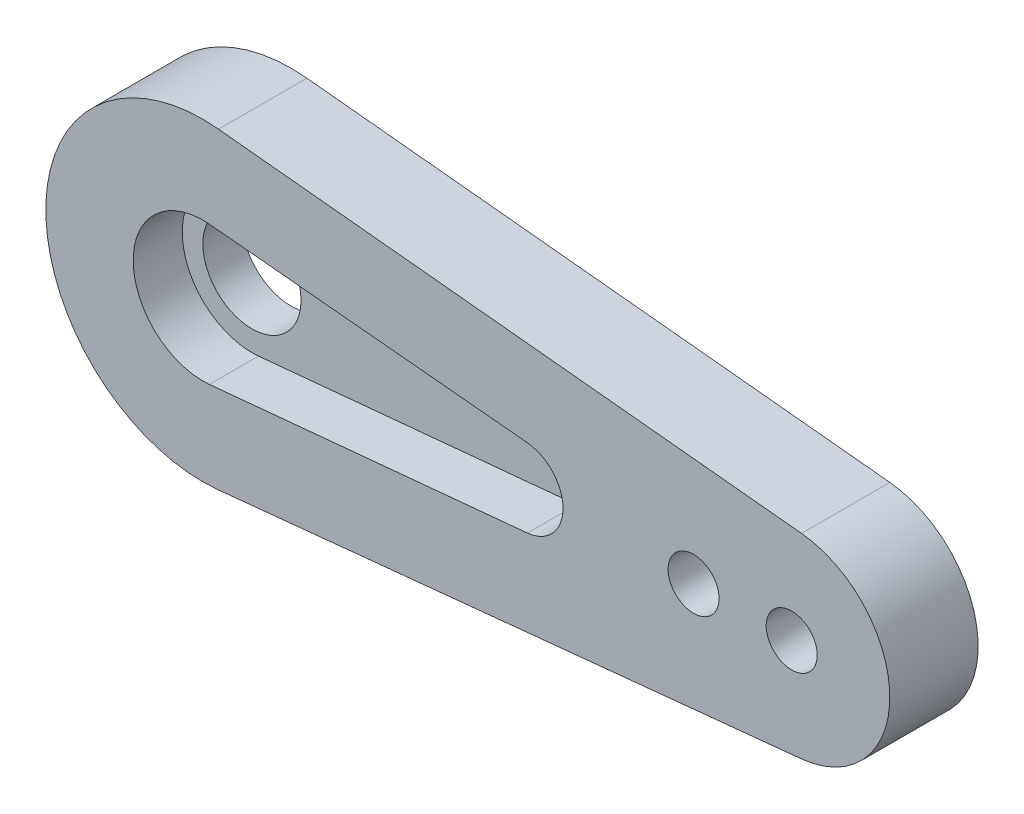
ISO-10303-21;
HEADER;
FILE_DESCRIPTION(('STEP AP214'),'2;1');
FILE_NAME('part.step','',(''),(''),'','','');
FILE_SCHEMA(('AUTOMOTIVE_DESIGN { 1 0 10303 214 1 1 1 1 }'));
ENDSEC;
DATA;
#1=APPLICATION_CONTEXT('core data for automotive mechanical design processes');
#2=APPLICATION_PROTOCOL_DEFINITION('international standard','automotive_design',2000,#1);
#3=PRODUCT_CONTEXT('',#1,'mechanical');
#4=PRODUCT('Part','Part','',(#3));
#5=PRODUCT_RELATED_PRODUCT_CATEGORY('part','',(#4));
#6=PRODUCT_DEFINITION_FORMATION('','',#4);
#7=PRODUCT_DEFINITION_CONTEXT('part definition',#1,'design');
#8=PRODUCT_DEFINITION('design','',#6,#7);
#9=PRODUCT_DEFINITION_SHAPE('','',#8);
#10=(LENGTH_UNIT() NAMED_UNIT(*) SI_UNIT(.MILLI.,.METRE.));
#11=(NAMED_UNIT(*) PLANE_ANGLE_UNIT() SI_UNIT($,.RADIAN.));
#12=(NAMED_UNIT(*) SI_UNIT($,.STERADIAN.) SOLID_ANGLE_UNIT());
#13=UNCERTAINTY_MEASURE_WITH_UNIT(LENGTH_MEASURE(1.E-05),#10,'distance_accuracy_value','');
#14=(GEOMETRIC_REPRESENTATION_CONTEXT(3) GLOBAL_UNCERTAINTY_ASSIGNED_CONTEXT((#13)) GLOBAL_UNIT_ASSIGNED_CONTEXT((#10,
#11,#12)) REPRESENTATION_CONTEXT('',''));
#15=CARTESIAN_POINT('',(0.,0.,0.));
#16=DIRECTION('',(0.,0.,1.));
#17=DIRECTION('',(1.,0.,0.));
#18=AXIS2_PLACEMENT_3D('',#15,#16,#17);
#19=CARTESIAN_POINT('',(0.,0.,2.5));
#20=DIRECTION('',(0.,0.,-1.));
#21=DIRECTION('',(-1.,0.,0.));
#22=AXIS2_PLACEMENT_3D('',#19,#20,#21);
#23=PLANE('',#22);
#24=CARTESIAN_POINT('',(25.,0.,2.5));
#25=DIRECTION('',(0.,0.,1.));
#26=DIRECTION('',(1.,0.,0.));
#27=AXIS2_PLACEMENT_3D('',#24,#25,#26);
#28=CIRCLE('',#27,1.3);
#29=CARTESIAN_POINT('',(26.3,0.,2.5));
#30=VERTEX_POINT('',#29);
#31=EDGE_CURVE('E281',#30,#30,#28,.T.);
#32=ORIENTED_EDGE('',*,*,#31,.F.);
#33=EDGE_LOOP('',(#32));
#34=FACE_BOUND('',#33,.T.);
#35=CARTESIAN_POINT('',(30.,0.,2.5));
#36=DIRECTION('',(0.,0.,1.));
#37=DIRECTION('',(1.,0.,0.));
#38=AXIS2_PLACEMENT_3D('',#35,#36,#37);
#39=CIRCLE('',#38,1.3);
#40=CARTESIAN_POINT('',(31.3,0.,2.5));
#41=VERTEX_POINT('',#40);
#42=EDGE_CURVE('E273',#41,#41,#39,.T.);
#43=ORIENTED_EDGE('',*,*,#42,.F.);
#44=EDGE_LOOP('',(#43));
#45=FACE_BOUND('',#44,.T.);
#46=CARTESIAN_POINT('',(0.,0.,2.5));
#47=DIRECTION('',(0.,0.,1.));
#48=DIRECTION('',(-1.,0.,0.));
#49=AXIS2_PLACEMENT_3D('',#46,#47,#48);
#50=CIRCLE('',#49,8.);
#51=CARTESIAN_POINT('',(0.8,7.95989949685296,2.5));
#52=VERTEX_POINT('',#51);
#53=CARTESIAN_POINT('',(0.8,-7.95989949685296,2.5));
#54=VERTEX_POINT('',#53);
#55=EDGE_CURVE('E103',#52,#54,#50,.T.);
#56=ORIENTED_EDGE('',*,*,#55,.T.);
#57=DIRECTION('',(0.99498743710662,0.0999999999999999,0.));
#58=VECTOR('',#57,1.);
#59=CARTESIAN_POINT('',(0.8,-7.95989949685296,2.5));
#60=LINE('',#59,#58);
#61=CARTESIAN_POINT('',(30.5,-4.9749371855331,2.5));
#62=VERTEX_POINT('',#61);
#63=EDGE_CURVE('E159',#54,#62,#60,.T.);
#64=ORIENTED_EDGE('',*,*,#63,.T.);
#65=CARTESIAN_POINT('',(30.,0.,2.5));
#66=DIRECTION('',(0.,0.,1.));
#67=DIRECTION('',(-1.,0.,0.));
#68=AXIS2_PLACEMENT_3D('',#65,#66,#67);
#69=CIRCLE('',#68,5.);
#70=CARTESIAN_POINT('',(30.5,4.9749371855331,2.5));
#71=VERTEX_POINT('',#70);
#72=EDGE_CURVE('E161',#62,#71,#69,.T.);
#73=ORIENTED_EDGE('',*,*,#72,.T.);
#74=DIRECTION('',(-0.99498743710662,0.0999999999999999,0.));
#75=VECTOR('',#74,1.);
#76=CARTESIAN_POINT('',(0.8,7.95989949685296,2.5));
#77=LINE('',#76,#75);
#78=EDGE_CURVE('E56',#71,#52,#77,.T.);
#79=ORIENTED_EDGE('',*,*,#78,.T.);
#80=EDGE_LOOP('',(#56,#64,#73,#79));
#81=FACE_BOUND('',#80,.T.);
#82=CARTESIAN_POINT('',(0.,0.,2.5));
#83=DIRECTION('',(0.,0.,1.));
#84=DIRECTION('',(1.,0.,0.));
#85=AXIS2_PLACEMENT_3D('',#82,#83,#84);
#86=CIRCLE('',#85,3.55);
#87=CARTESIAN_POINT('',(0.336544342507645,3.53401158819918,2.5));
#88=VERTEX_POINT('',#87);
#89=CARTESIAN_POINT('',(0.336544342507645,-3.53401158819918,2.5));
#90=VERTEX_POINT('',#89);
#91=EDGE_CURVE('E131',#88,#90,#86,.T.);
#92=ORIENTED_EDGE('',*,*,#91,.F.);
#93=DIRECTION('',(-0.995496222027938,0.0948012232415904,0.));
#94=VECTOR('',#93,1.);
#95=CARTESIAN_POINT('',(0.336544342507645,3.53401158819918,2.5));
#96=LINE('',#95,#94);
#97=CARTESIAN_POINT('',(16.5396024464832,1.99099244405587,2.5));
#98=VERTEX_POINT('',#97);
#99=EDGE_CURVE('E138',#98,#88,#96,.T.);
#100=ORIENTED_EDGE('',*,*,#99,.F.);
#101=CARTESIAN_POINT('',(16.35,0.,2.5));
#102=DIRECTION('',(0.,0.,1.));
#103=DIRECTION('',(1.,0.,0.));
#104=AXIS2_PLACEMENT_3D('',#101,#102,#103);
#105=CIRCLE('',#104,2.);
#106=CARTESIAN_POINT('',(16.5396024464832,-1.99099244405587,2.5));
#107=VERTEX_POINT('',#106);
#108=EDGE_CURVE('E136',#107,#98,#105,.T.);
#109=ORIENTED_EDGE('',*,*,#108,.F.);
#110=DIRECTION('',(0.995496222027938,0.0948012232415903,0.));
#111=VECTOR('',#110,1.);
#112=CARTESIAN_POINT('',(16.5396024464832,-1.99099244405587,2.5));
#113=LINE('',#112,#111);
#114=EDGE_CURVE('E133',#90,#107,#113,.T.);
#115=ORIENTED_EDGE('',*,*,#114,.F.);
#116=EDGE_LOOP('',(#92,#100,#109,#115));
#117=FACE_BOUND('',#116,.T.);
#118=ADVANCED_FACE('F33',(#34,#45,#81,#117),#23,.F.);
#119=CARTESIAN_POINT('',(0.,0.,2.5));
#120=DIRECTION('',(0.,0.,-1.));
#121=DIRECTION('',(-1.,0.,0.));
#122=AXIS2_PLACEMENT_3D('',#119,#120,#121);
#123=CYLINDRICAL_SURFACE('',#122,8.);
#124=DIRECTION('',(0.,0.,-1.));
#125=VECTOR('',#124,1.);
#126=CARTESIAN_POINT('',(0.8,7.95989949685296,2.5));
#127=LINE('',#126,#125);
#128=CARTESIAN_POINT('',(0.8,7.95989949685296,-2.));
#129=VERTEX_POINT('',#128);
#130=EDGE_CURVE('E98',#52,#129,#127,.T.);
#131=ORIENTED_EDGE('',*,*,#130,.T.);
#132=CARTESIAN_POINT('',(0.,0.,-2.));
#133=DIRECTION('',(0.,0.,-1.));
#134=DIRECTION('',(-1.,0.,0.));
#135=AXIS2_PLACEMENT_3D('',#132,#133,#134);
#136=CIRCLE('',#135,8.);
#137=CARTESIAN_POINT('',(0.799999999999999,-7.95989949685296,-2.));
#138=VERTEX_POINT('',#137);
#139=EDGE_CURVE('E102',#138,#129,#136,.T.);
#140=ORIENTED_EDGE('',*,*,#139,.F.);
#141=DIRECTION('',(0.,0.,-1.));
#142=VECTOR('',#141,1.);
#143=CARTESIAN_POINT('',(0.8,-7.95989949685296,2.5));
#144=LINE('',#143,#142);
#145=EDGE_CURVE('E11',#54,#138,#144,.T.);
#146=ORIENTED_EDGE('',*,*,#145,.F.);
#147=ORIENTED_EDGE('',*,*,#55,.F.);
#148=EDGE_LOOP('',(#131,#140,#146,#147));
#149=FACE_BOUND('',#148,.T.);
#150=ADVANCED_FACE('F35',(#149),#123,.T.);
#151=CARTESIAN_POINT('',(0.8,-7.95989949685296,2.5));
#152=DIRECTION('',(-0.0999999999999999,0.99498743710662,0.));
#153=DIRECTION('',(-0.99498743710662,-0.0999999999999999,0.));
#154=AXIS2_PLACEMENT_3D('',#151,#152,#153);
#155=PLANE('',#154);
#156=ORIENTED_EDGE('',*,*,#145,.T.);
#157=DIRECTION('',(-0.99498743710662,-0.0999999999999999,0.));
#158=VECTOR('',#157,1.);
#159=CARTESIAN_POINT('',(0.799999999999999,-7.95989949685296,-2.));
#160=LINE('',#159,#158);
#161=CARTESIAN_POINT('',(30.5,-4.9749371855331,-2.));
#162=VERTEX_POINT('',#161);
#163=EDGE_CURVE('E120',#162,#138,#160,.T.);
#164=ORIENTED_EDGE('',*,*,#163,.F.);
#165=DIRECTION('',(0.,0.,-1.));
#166=VECTOR('',#165,1.);
#167=CARTESIAN_POINT('',(30.5,-4.9749371855331,2.5));
#168=LINE('',#167,#166);
#169=EDGE_CURVE('E41',#62,#162,#168,.T.);
#170=ORIENTED_EDGE('',*,*,#169,.F.);
#171=ORIENTED_EDGE('',*,*,#63,.F.);
#172=EDGE_LOOP('',(#156,#164,#170,#171));
#173=FACE_BOUND('',#172,.T.);
#174=ADVANCED_FACE('F169',(#173),#155,.F.);
#175=CARTESIAN_POINT('',(30.,0.,2.5));
#176=DIRECTION('',(0.,0.,-1.));
#177=DIRECTION('',(-1.,0.,0.));
#178=AXIS2_PLACEMENT_3D('',#175,#176,#177);
#179=CYLINDRICAL_SURFACE('',#178,5.);
#180=ORIENTED_EDGE('',*,*,#169,.T.);
#181=CARTESIAN_POINT('',(30.,0.,-2.));
#182=DIRECTION('',(0.,0.,-1.));
#183=DIRECTION('',(-1.,0.,0.));
#184=AXIS2_PLACEMENT_3D('',#181,#182,#183);
#185=CIRCLE('',#184,5.);
#186=CARTESIAN_POINT('',(30.5,4.9749371855331,-2.));
#187=VERTEX_POINT('',#186);
#188=EDGE_CURVE('E114',#187,#162,#185,.T.);
#189=ORIENTED_EDGE('',*,*,#188,.F.);
#190=DIRECTION('',(0.,0.,-1.));
#191=VECTOR('',#190,1.);
#192=CARTESIAN_POINT('',(30.5,4.9749371855331,2.5));
#193=LINE('',#192,#191);
#194=EDGE_CURVE('E105',#71,#187,#193,.T.);
#195=ORIENTED_EDGE('',*,*,#194,.F.);
#196=ORIENTED_EDGE('',*,*,#72,.F.);
#197=EDGE_LOOP('',(#180,#189,#195,#196));
#198=FACE_BOUND('',#197,.T.);
#199=ADVANCED_FACE('F167',(#198),#179,.T.);
#200=CARTESIAN_POINT('',(0.8,7.95989949685296,2.5));
#201=DIRECTION('',(-0.0999999999999999,-0.99498743710662,0.));
#202=DIRECTION('',(0.99498743710662,-0.0999999999999999,0.));
#203=AXIS2_PLACEMENT_3D('',#200,#201,#202);
#204=PLANE('',#203);
#205=ORIENTED_EDGE('',*,*,#194,.T.);
#206=DIRECTION('',(0.99498743710662,-0.0999999999999999,0.));
#207=VECTOR('',#206,1.);
#208=CARTESIAN_POINT('',(0.8,7.95989949685296,-2.));
#209=LINE('',#208,#207);
#210=EDGE_CURVE('E108',#129,#187,#209,.T.);
#211=ORIENTED_EDGE('',*,*,#210,.F.);
#212=ORIENTED_EDGE('',*,*,#130,.F.);
#213=ORIENTED_EDGE('',*,*,#78,.F.);
#214=EDGE_LOOP('',(#205,#211,#212,#213));
#215=FACE_BOUND('',#214,.T.);
#216=ADVANCED_FACE('F109',(#215),#204,.F.);
#217=CARTESIAN_POINT('',(0.,0.,2.5));
#218=DIRECTION('',(0.,0.,-1.));
#219=DIRECTION('',(-1.,0.,0.));
#220=AXIS2_PLACEMENT_3D('',#217,#218,#219);
#221=CYLINDRICAL_SURFACE('',#220,3.55);
#222=CARTESIAN_POINT('',(0.,0.,0.));
#223=DIRECTION('',(0.,0.,1.));
#224=DIRECTION('',(1.,0.,0.));
#225=AXIS2_PLACEMENT_3D('',#222,#223,#224);
#226=CIRCLE('',#225,3.55);
#227=CARTESIAN_POINT('',(0.336544342507645,3.53401158819918,0.));
#228=VERTEX_POINT('',#227);
#229=CARTESIAN_POINT('',(0.336544342507645,-3.53401158819918,0.));
#230=VERTEX_POINT('',#229);
#231=EDGE_CURVE('E130',#228,#230,#226,.T.);
#232=ORIENTED_EDGE('',*,*,#231,.F.);
#233=DIRECTION('',(0.,0.,-1.));
#234=VECTOR('',#233,1.);
#235=CARTESIAN_POINT('',(0.336544342507645,3.53401158819918,2.5));
#236=LINE('',#235,#234);
#237=EDGE_CURVE('E140',#88,#228,#236,.T.);
#238=ORIENTED_EDGE('',*,*,#237,.F.);
#239=ORIENTED_EDGE('',*,*,#91,.T.);
#240=DIRECTION('',(0.,0.,-1.));
#241=VECTOR('',#240,1.);
#242=CARTESIAN_POINT('',(0.336544342507645,-3.53401158819918,2.5));
#243=LINE('',#242,#241);
#244=EDGE_CURVE('E155',#90,#230,#243,.T.);
#245=ORIENTED_EDGE('',*,*,#244,.T.);
#246=EDGE_LOOP('',(#232,#238,#239,#245));
#247=FACE_BOUND('',#246,.T.);
#248=ADVANCED_FACE('F182',(#247),#221,.F.);
#249=CARTESIAN_POINT('',(16.5396024464832,-1.99099244405587,2.5));
#250=DIRECTION('',(-0.0948012232415903,0.995496222027938,0.));
#251=DIRECTION('',(-0.995496222027938,-0.0948012232415903,0.));
#252=AXIS2_PLACEMENT_3D('',#249,#250,#251);
#253=PLANE('',#252);
#254=DIRECTION('',(0.995496222027938,0.0948012232415903,0.));
#255=VECTOR('',#254,1.);
#256=CARTESIAN_POINT('',(16.5396024464832,-1.99099244405587,0.));
#257=LINE('',#256,#255);
#258=CARTESIAN_POINT('',(16.5396024464832,-1.99099244405587,0.));
#259=VERTEX_POINT('',#258);
#260=EDGE_CURVE('E143',#230,#259,#257,.T.);
#261=ORIENTED_EDGE('',*,*,#260,.F.);
#262=ORIENTED_EDGE('',*,*,#244,.F.);
#263=ORIENTED_EDGE('',*,*,#114,.T.);
#264=DIRECTION('',(0.,0.,-1.));
#265=VECTOR('',#264,1.);
#266=CARTESIAN_POINT('',(16.5396024464832,-1.99099244405587,2.5));
#267=LINE('',#266,#265);
#268=EDGE_CURVE('E153',#107,#259,#267,.T.);
#269=ORIENTED_EDGE('',*,*,#268,.T.);
#270=EDGE_LOOP('',(#261,#262,#263,#269));
#271=FACE_BOUND('',#270,.T.);
#272=ADVANCED_FACE('F184',(#271),#253,.T.);
#273=CARTESIAN_POINT('',(16.35,0.,2.5));
#274=DIRECTION('',(0.,0.,-1.));
#275=DIRECTION('',(-1.,0.,0.));
#276=AXIS2_PLACEMENT_3D('',#273,#274,#275);
#277=CYLINDRICAL_SURFACE('',#276,2.);
#278=CARTESIAN_POINT('',(16.35,0.,0.));
#279=DIRECTION('',(0.,0.,1.));
#280=DIRECTION('',(1.,0.,0.));
#281=AXIS2_PLACEMENT_3D('',#278,#279,#280);
#282=CIRCLE('',#281,2.);
#283=CARTESIAN_POINT('',(16.5396024464832,1.99099244405587,0.));
#284=VERTEX_POINT('',#283);
#285=EDGE_CURVE('E146',#259,#284,#282,.T.);
#286=ORIENTED_EDGE('',*,*,#285,.F.);
#287=ORIENTED_EDGE('',*,*,#268,.F.);
#288=ORIENTED_EDGE('',*,*,#108,.T.);
#289=DIRECTION('',(0.,0.,-1.));
#290=VECTOR('',#289,1.);
#291=CARTESIAN_POINT('',(16.5396024464832,1.99099244405587,2.5));
#292=LINE('',#291,#290);
#293=EDGE_CURVE('E48',#98,#284,#292,.T.);
#294=ORIENTED_EDGE('',*,*,#293,.T.);
#295=EDGE_LOOP('',(#286,#287,#288,#294));
#296=FACE_BOUND('',#295,.T.);
#297=ADVANCED_FACE('F192',(#296),#277,.F.);
#298=CARTESIAN_POINT('',(0.336544342507645,3.53401158819918,2.5));
#299=DIRECTION('',(-0.0948012232415904,-0.995496222027938,0.));
#300=DIRECTION('',(0.995496222027938,-0.0948012232415904,0.));
#301=AXIS2_PLACEMENT_3D('',#298,#299,#300);
#302=PLANE('',#301);
#303=DIRECTION('',(-0.995496222027938,0.0948012232415904,0.));
#304=VECTOR('',#303,1.);
#305=CARTESIAN_POINT('',(0.336544342507645,3.53401158819918,0.));
#306=LINE('',#305,#304);
#307=EDGE_CURVE('E134',#284,#228,#306,.T.);
#308=ORIENTED_EDGE('',*,*,#307,.F.);
#309=ORIENTED_EDGE('',*,*,#293,.F.);
#310=ORIENTED_EDGE('',*,*,#99,.T.);
#311=ORIENTED_EDGE('',*,*,#237,.T.);
#312=EDGE_LOOP('',(#308,#309,#310,#311));
#313=FACE_BOUND('',#312,.T.);
#314=ADVANCED_FACE('F190',(#313),#302,.T.);
#315=CARTESIAN_POINT('',(0.,0.,-2.));
#316=DIRECTION('',(0.,0.,-1.));
#317=DIRECTION('',(-1.,0.,0.));
#318=AXIS2_PLACEMENT_3D('',#315,#316,#317);
#319=PLANE('',#318);
#320=CARTESIAN_POINT('',(25.,0.,-2.));
#321=DIRECTION('',(0.,0.,1.));
#322=DIRECTION('',(1.,0.,0.));
#323=AXIS2_PLACEMENT_3D('',#320,#321,#322);
#324=CIRCLE('',#323,1.3);
#325=CARTESIAN_POINT('',(26.3,0.,-2.));
#326=VERTEX_POINT('',#325);
#327=EDGE_CURVE('E278',#326,#326,#324,.T.);
#328=ORIENTED_EDGE('',*,*,#327,.T.);
#329=EDGE_LOOP('',(#328));
#330=FACE_BOUND('',#329,.T.);
#331=CARTESIAN_POINT('',(30.,0.,-2.));
#332=DIRECTION('',(0.,0.,1.));
#333=DIRECTION('',(1.,0.,0.));
#334=AXIS2_PLACEMENT_3D('',#331,#332,#333);
#335=CIRCLE('',#334,1.3);
#336=CARTESIAN_POINT('',(31.3,0.,-2.));
#337=VERTEX_POINT('',#336);
#338=EDGE_CURVE('E271',#337,#337,#335,.T.);
#339=ORIENTED_EDGE('',*,*,#338,.T.);
#340=EDGE_LOOP('',(#339));
#341=FACE_BOUND('',#340,.T.);
#342=ORIENTED_EDGE('',*,*,#139,.T.);
#343=ORIENTED_EDGE('',*,*,#210,.T.);
#344=ORIENTED_EDGE('',*,*,#188,.T.);
#345=ORIENTED_EDGE('',*,*,#163,.T.);
#346=EDGE_LOOP('',(#342,#343,#344,#345));
#347=FACE_BOUND('',#346,.T.);
#348=CARTESIAN_POINT('',(0.,0.,-2.));
#349=DIRECTION('',(0.,0.,-1.));
#350=DIRECTION('',(-1.,0.,0.));
#351=AXIS2_PLACEMENT_3D('',#348,#349,#350);
#352=CIRCLE('',#351,2.5);
#353=CARTESIAN_POINT('',(-2.5,0.,-2.));
#354=VERTEX_POINT('',#353);
#355=EDGE_CURVE('E121',#354,#354,#352,.T.);
#356=ORIENTED_EDGE('',*,*,#355,.F.);
#357=EDGE_LOOP('',(#356));
#358=FACE_BOUND('',#357,.T.);
#359=ADVANCED_FACE('F117',(#330,#341,#347,#358),#319,.T.);
#360=CARTESIAN_POINT('',(0.,0.,0.));
#361=DIRECTION('',(0.,0.,-1.));
#362=DIRECTION('',(-1.,0.,0.));
#363=AXIS2_PLACEMENT_3D('',#360,#361,#362);
#364=PLANE('',#363);
#365=ORIENTED_EDGE('',*,*,#231,.T.);
#366=ORIENTED_EDGE('',*,*,#260,.T.);
#367=ORIENTED_EDGE('',*,*,#285,.T.);
#368=ORIENTED_EDGE('',*,*,#307,.T.);
#369=EDGE_LOOP('',(#365,#366,#367,#368));
#370=FACE_BOUND('',#369,.T.);
#371=CARTESIAN_POINT('',(0.,0.,0.));
#372=DIRECTION('',(0.,0.,-1.));
#373=DIRECTION('',(-1.,0.,0.));
#374=AXIS2_PLACEMENT_3D('',#371,#372,#373);
#375=CIRCLE('',#374,2.5);
#376=CARTESIAN_POINT('',(-2.5,0.,0.));
#377=VERTEX_POINT('',#376);
#378=EDGE_CURVE('E124',#377,#377,#375,.T.);
#379=ORIENTED_EDGE('',*,*,#378,.T.);
#380=EDGE_LOOP('',(#379));
#381=FACE_BOUND('',#380,.T.);
#382=ADVANCED_FACE('F188',(#370,#381),#364,.F.);
#383=CARTESIAN_POINT('',(0.,0.,-2.));
#384=DIRECTION('',(0.,0.,1.));
#385=DIRECTION('',(1.,0.,0.));
#386=AXIS2_PLACEMENT_3D('',#383,#384,#385);
#387=CYLINDRICAL_SURFACE('',#386,2.5);
#388=ORIENTED_EDGE('',*,*,#355,.T.);
#389=EDGE_LOOP('',(#388));
#390=FACE_BOUND('',#389,.T.);
#391=ORIENTED_EDGE('',*,*,#378,.F.);
#392=EDGE_LOOP('',(#391));
#393=FACE_BOUND('',#392,.T.);
#394=ADVANCED_FACE('F229',(#390,#393),#387,.F.);
#395=CARTESIAN_POINT('',(30.,0.,-2.));
#396=DIRECTION('',(0.,0.,1.));
#397=DIRECTION('',(1.,0.,0.));
#398=AXIS2_PLACEMENT_3D('',#395,#396,#397);
#399=CYLINDRICAL_SURFACE('',#398,1.3);
#400=ORIENTED_EDGE('',*,*,#338,.F.);
#401=EDGE_LOOP('',(#400));
#402=FACE_BOUND('',#401,.T.);
#403=ORIENTED_EDGE('',*,*,#42,.T.);
#404=EDGE_LOOP('',(#403));
#405=FACE_BOUND('',#404,.T.);
#406=ADVANCED_FACE('F243',(#402,#405),#399,.F.);
#407=CARTESIAN_POINT('',(25.,0.,-2.));
#408=DIRECTION('',(0.,0.,1.));
#409=DIRECTION('',(1.,0.,0.));
#410=AXIS2_PLACEMENT_3D('',#407,#408,#409);
#411=CYLINDRICAL_SURFACE('',#410,1.3);
#412=ORIENTED_EDGE('',*,*,#327,.F.);
#413=EDGE_LOOP('',(#412));
#414=FACE_BOUND('',#413,.T.);
#415=ORIENTED_EDGE('',*,*,#31,.T.);
#416=EDGE_LOOP('',(#415));
#417=FACE_BOUND('',#416,.T.);
#418=ADVANCED_FACE('F248',(#414,#417),#411,.F.);
#419=CLOSED_SHELL('',(#118,#150,#174,#199,#216,#248,#272,#297,#314,#359,#382,#394,#406,#418));
#420=MANIFOLD_SOLID_BREP('B2',#419);
#421=ADVANCED_BREP_SHAPE_REPRESENTATION('',(#18,#420),#14);
#422=SHAPE_DEFINITION_REPRESENTATION(#9,#421);
ENDSEC;
END-ISO-10303-21;
